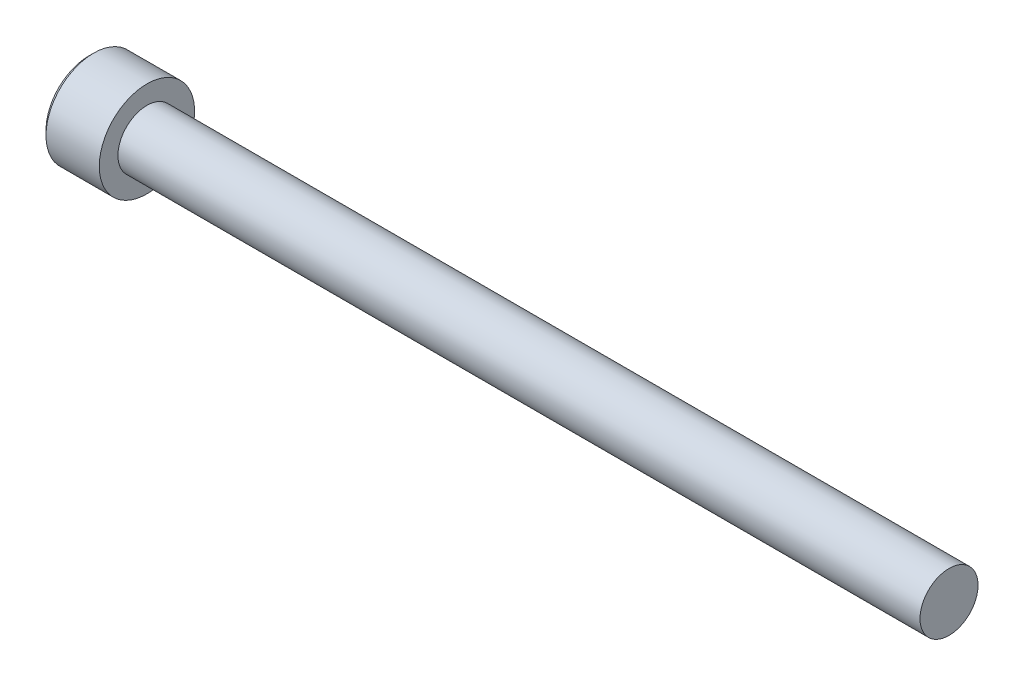
ISO-10303-21;
HEADER;
FILE_DESCRIPTION(('STEP AP214'),'2;1');
FILE_NAME('part.step','',(''),(''),'','','');
FILE_SCHEMA(('AUTOMOTIVE_DESIGN { 1 0 10303 214 1 1 1 1 }'));
ENDSEC;
DATA;
#1=APPLICATION_CONTEXT('core data for automotive mechanical design processes');
#2=APPLICATION_PROTOCOL_DEFINITION('international standard','automotive_design',2000,#1);
#3=PRODUCT_CONTEXT('',#1,'mechanical');
#4=PRODUCT('Part','Part','',(#3));
#5=PRODUCT_RELATED_PRODUCT_CATEGORY('part','',(#4));
#6=PRODUCT_DEFINITION_FORMATION('','',#4);
#7=PRODUCT_DEFINITION_CONTEXT('part definition',#1,'design');
#8=PRODUCT_DEFINITION('design','',#6,#7);
#9=PRODUCT_DEFINITION_SHAPE('','',#8);
#10=(LENGTH_UNIT() NAMED_UNIT(*) SI_UNIT(.MILLI.,.METRE.));
#11=(NAMED_UNIT(*) PLANE_ANGLE_UNIT() SI_UNIT($,.RADIAN.));
#12=(NAMED_UNIT(*) SI_UNIT($,.STERADIAN.) SOLID_ANGLE_UNIT());
#13=UNCERTAINTY_MEASURE_WITH_UNIT(LENGTH_MEASURE(1.E-05),#10,'distance_accuracy_value','');
#14=(GEOMETRIC_REPRESENTATION_CONTEXT(3) GLOBAL_UNCERTAINTY_ASSIGNED_CONTEXT((#13)) GLOBAL_UNIT_ASSIGNED_CONTEXT((#10,
#11,#12)) REPRESENTATION_CONTEXT('',''));
#15=CARTESIAN_POINT('',(0.,0.,0.));
#16=DIRECTION('',(0.,0.,1.));
#17=DIRECTION('',(1.,0.,0.));
#18=AXIS2_PLACEMENT_3D('',#15,#16,#17);
#19=CARTESIAN_POINT('',(-2.28600000000007,-1.14567944042317,1.984375));
#20=DIRECTION('',(0.,0.,1.));
#21=DIRECTION('',(1.,0.,0.));
#22=AXIS2_PLACEMENT_3D('',#19,#20,#21);
#23=PLANE('',#22);
#24=CARTESIAN_POINT('',(-4.82599999995852,1.14567944044653,1.98437499999554));
#25=CARTESIAN_POINT('',(-4.78691618362732,1.06743880343266,1.9843749999984));
#26=CARTESIAN_POINT('',(-4.75011447684892,0.987898318960917,1.98437499999957));
#27=CARTESIAN_POINT('',(-4.68265620500518,0.825677042028778,1.98437500000043));
#28=CARTESIAN_POINT('',(-4.65204056061138,0.742979382529199,1.98437500000012));
#29=CARTESIAN_POINT('',(-4.5991739228306,0.575193959555969,1.98437499999988));
#30=CARTESIAN_POINT('',(-4.57689462080725,0.490115359117279,1.98437499999997));
#31=CARTESIAN_POINT('',(-4.54259467221837,0.318093091130193,1.98437500000003));
#32=CARTESIAN_POINT('',(-4.5305423022885,0.231156054976726,1.984375));
#33=CARTESIAN_POINT('',(-4.52249110263747,0.119918521511051,1.984375));
#34=CARTESIAN_POINT('',(-4.52118947557477,0.0959468443046798,1.984375));
#35=CARTESIAN_POINT('',(-4.51945182629813,0.0479845644411998,1.984375));
#36=CARTESIAN_POINT('',(-4.51901533386223,0.0239939791589393,1.984375));
#37=CARTESIAN_POINT('',(-4.51901809008399,-0.0602201717457363,1.984375));
#38=CARTESIAN_POINT('',(-4.52177452299902,-0.120461721905447,1.984375));
#39=CARTESIAN_POINT('',(-4.5326365512493,-0.240474970989197,1.984375));
#40=CARTESIAN_POINT('',(-4.54074587749718,-0.300246312758427,1.984375));
#41=CARTESIAN_POINT('',(-4.57259622946939,-0.478763752804282,1.984375));
#42=CARTESIAN_POINT('',(-4.60385422611702,-0.596208828937734,1.984375));
#43=CARTESIAN_POINT('',(-4.66780003592237,-0.785921487441256,1.984375));
#44=CARTESIAN_POINT('',(-4.69623457768558,-0.859734609866899,1.984375));
#45=CARTESIAN_POINT('',(-4.75786140400812,-1.00456595519282,1.984375));
#46=CARTESIAN_POINT('',(-4.79100779300359,-1.07560356657101,1.984375));
#47=CARTESIAN_POINT('',(-4.82599999995643,-1.14567944044724,1.984375));
#48=B_SPLINE_CURVE_WITH_KNOTS('',3,(#24,#25,#26,#27,#28,#29,#30,#31,#32,#33,#34,#35,#36,#37,#38,
#39,#40,#41,#42,#43,#44,#45,#46,#47),.UNSPECIFIED.,.F.,.F.,(4,2,2,2,2,2,2,2,2,2,2,4),(0.,
0.262559005207405,0.526801735838036,0.790138824405318,1.05265603861765,1.12466619182083,
1.19663719499031,1.3772702672652,1.55802937209382,1.92104085090328,2.15819130092264,
2.39317265078575),.UNSPECIFIED.);
#49=CARTESIAN_POINT('',(-4.82599999996829,1.14567944041753,1.98437500003084));
#50=VERTEX_POINT('',#49);
#51=CARTESIAN_POINT('',(-4.8259999999622,-1.14567944043207,1.98437500001542));
#52=VERTEX_POINT('',#51);
#53=EDGE_CURVE('E20',#50,#52,#48,.T.);
#54=ORIENTED_EDGE('',*,*,#53,.F.);
#55=DIRECTION('',(1.,0.,0.));
#56=VECTOR('',#55,1.);
#57=CARTESIAN_POINT('',(-2.28600000000007,1.14567944042316,1.984375));
#58=LINE('',#57,#56);
#59=CARTESIAN_POINT('',(-2.28600000000007,1.14567944042316,1.984375));
#60=VERTEX_POINT('',#59);
#61=EDGE_CURVE('E68',#50,#60,#58,.T.);
#62=ORIENTED_EDGE('',*,*,#61,.T.);
#63=DIRECTION('',(0.,1.,0.));
#64=VECTOR('',#63,1.);
#65=CARTESIAN_POINT('',(-2.28600000000007,0.,1.984375));
#66=LINE('',#65,#64);
#67=CARTESIAN_POINT('',(-2.28600000000007,-1.14567944042317,1.984375));
#68=VERTEX_POINT('',#67);
#69=EDGE_CURVE('E74',#68,#60,#66,.T.);
#70=ORIENTED_EDGE('',*,*,#69,.F.);
#71=DIRECTION('',(1.,0.,0.));
#72=VECTOR('',#71,1.);
#73=CARTESIAN_POINT('',(-2.28600000000007,-1.14567944042317,1.984375));
#74=LINE('',#73,#72);
#75=EDGE_CURVE('E71',#68,#52,#74,.F.);
#76=ORIENTED_EDGE('',*,*,#75,.T.);
#77=EDGE_LOOP('',(#54,#62,#70,#76));
#78=FACE_BOUND('',#77,.T.);
#79=ADVANCED_FACE('F16',(#78),#23,.F.);
#80=CARTESIAN_POINT('',(-2.28600000000007,0.,0.));
#81=DIRECTION('',(-1.,0.,0.));
#82=DIRECTION('',(0.,0.,1.));
#83=AXIS2_PLACEMENT_3D('',#80,#81,#82);
#84=PLANE('',#83);
#85=DIRECTION('',(0.,0.5,0.866025403784439));
#86=VECTOR('',#85,1.);
#87=CARTESIAN_POINT('',(-2.28600000000007,2.29135888084633,0.));
#88=LINE('',#87,#86);
#89=CARTESIAN_POINT('',(-2.28600000000007,2.29135888084633,0.));
#90=VERTEX_POINT('',#89);
#91=CARTESIAN_POINT('',(-2.28600000000007,1.14567944042316,-1.984375));
#92=VERTEX_POINT('',#91);
#93=EDGE_CURVE('E82',#90,#92,#88,.F.);
#94=ORIENTED_EDGE('',*,*,#93,.T.);
#95=DIRECTION('',(0.,1.,0.));
#96=VECTOR('',#95,1.);
#97=CARTESIAN_POINT('',(-2.28600000000007,1.14567944042316,-1.984375));
#98=LINE('',#97,#96);
#99=CARTESIAN_POINT('',(-2.28600000000007,-1.14567944042316,-1.984375));
#100=VERTEX_POINT('',#99);
#101=EDGE_CURVE('E242',#92,#100,#98,.F.);
#102=ORIENTED_EDGE('',*,*,#101,.T.);
#103=DIRECTION('',(0.,0.5,-0.866025403784439));
#104=VECTOR('',#103,1.);
#105=CARTESIAN_POINT('',(-2.28600000000007,-1.14567944042316,-1.984375));
#106=LINE('',#105,#104);
#107=CARTESIAN_POINT('',(-2.28600000000007,-2.29135888084633,0.));
#108=VERTEX_POINT('',#107);
#109=EDGE_CURVE('E227',#100,#108,#106,.F.);
#110=ORIENTED_EDGE('',*,*,#109,.T.);
#111=DIRECTION('',(0.,-0.5,-0.866025403784439));
#112=VECTOR('',#111,1.);
#113=CARTESIAN_POINT('',(-2.28600000000007,-2.29135888084633,0.));
#114=LINE('',#113,#112);
#115=EDGE_CURVE('E224',#108,#68,#114,.F.);
#116=ORIENTED_EDGE('',*,*,#115,.T.);
#117=ORIENTED_EDGE('',*,*,#69,.T.);
#118=DIRECTION('',(0.,-0.5,0.866025403784439));
#119=VECTOR('',#118,1.);
#120=CARTESIAN_POINT('',(-2.28600000000007,1.14567944042316,1.984375));
#121=LINE('',#120,#119);
#122=EDGE_CURVE('E81',#60,#90,#121,.F.);
#123=ORIENTED_EDGE('',*,*,#122,.T.);
#124=EDGE_LOOP('',(#94,#102,#110,#116,#117,#123));
#125=FACE_BOUND('',#124,.T.);
#126=ADVANCED_FACE('F160',(#125),#84,.T.);
#127=CARTESIAN_POINT('',(-2.28600000000007,-1.14567944042316,-1.984375));
#128=DIRECTION('',(0.,-0.866025403784439,-0.5));
#129=DIRECTION('',(0.,0.5,-0.866025403784439));
#130=AXIS2_PLACEMENT_3D('',#127,#128,#129);
#131=PLANE('',#130);
#132=CARTESIAN_POINT('',(-4.82599999995871,-1.14567944040756,-1.98437500001887));
#133=CARTESIAN_POINT('',(-4.78666022792997,-1.18505700230148,-1.91617106214563));
#134=CARTESIAN_POINT('',(-4.74963132844072,-1.22509295783734,-1.8468267530301));
#135=CARTESIAN_POINT('',(-4.68183299424977,-1.30673037975396,-1.70542659047317));
#136=CARTESIAN_POINT('',(-4.65110127019237,-1.34833960561553,-1.63335729721673));
#137=CARTESIAN_POINT('',(-4.59845762010516,-1.432242568594,-1.48803310243203));
#138=CARTESIAN_POINT('',(-4.57641341195893,-1.47451494967301,-1.41481519064643));
#139=CARTESIAN_POINT('',(-4.54245011067441,-1.55999007976842,-1.26676792253773));
#140=CARTESIAN_POINT('',(-4.53050567471972,-1.6031902195197,-1.19194308559438));
#141=CARTESIAN_POINT('',(-4.51972842752365,-1.67764765054852,-1.06297903205139));
#142=CARTESIAN_POINT('',(-4.51813352794834,-1.70880881707173,-1.00900630841009));
#143=CARTESIAN_POINT('',(-4.52082392138599,-1.77108016542046,-0.901149169214274));
#144=CARTESIAN_POINT('',(-4.52511127545884,-1.80219032554946,-0.847264791239237));
#145=CARTESIAN_POINT('',(-4.53932219421538,-1.86411684097343,-0.740004920189235));
#146=CARTESIAN_POINT('',(-4.54925206045723,-1.8949328285454,-0.686630064029166));
#147=CARTESIAN_POINT('',(-4.5742029484467,-1.95603190279815,-0.580803363127978));
#148=CARTESIAN_POINT('',(-4.58922357974385,-1.98631503016081,-0.528351447923769));
#149=CARTESIAN_POINT('',(-4.63380478900425,-2.06386502548479,-0.394030915895904));
#150=CARTESIAN_POINT('',(-4.66672213384104,-2.11065153226583,-0.312994309042484));
#151=CARTESIAN_POINT('',(-4.72228952038986,-2.17944749410732,-0.193836207777459));
#152=CARTESIAN_POINT('',(-4.74181309375939,-2.20211890802843,-0.154568166986659));
#153=CARTESIAN_POINT('',(-4.78263970065987,-2.24704195201531,-0.0767591723707469));
#154=CARTESIAN_POINT('',(-4.80394164363173,-2.2692938292399,-0.0382177904539708));
#155=CARTESIAN_POINT('',(-4.82599999995675,-2.29135888085868,2.13931096265935E-11));
#156=B_SPLINE_CURVE_WITH_KNOTS('',3,(#132,#133,#134,#135,#136,#137,#138,#139,#140,#141,#142,
#143,#144,#145,#146,#147,#148,#149,#150,#151,#152,#153,#154,#155),.UNSPECIFIED.,.F.,.F.,(4,2,2,
2,2,2,2,2,2,2,2,4),(0.,0.264284909626495,0.530108996358094,0.791712695414128,1.05265800174404,
1.23942150116703,1.42625045663858,1.61328847394198,1.80031214908683,2.09727151182814,
2.24534838946042,2.39333511890876),.UNSPECIFIED.);
#157=CARTESIAN_POINT('',(-4.8259999999622,-1.14567944043207,-1.98437500001542));
#158=VERTEX_POINT('',#157);
#159=CARTESIAN_POINT('',(-4.82599999996846,-2.2913588808704,-2.00043543490866E-11));
#160=VERTEX_POINT('',#159);
#161=EDGE_CURVE('E162',#158,#160,#156,.T.);
#162=ORIENTED_EDGE('',*,*,#161,.T.);
#163=DIRECTION('',(1.,0.,0.));
#164=VECTOR('',#163,1.);
#165=CARTESIAN_POINT('',(-2.28600000000007,-2.29135888084633,0.));
#166=LINE('',#165,#164);
#167=EDGE_CURVE('E235',#160,#108,#166,.T.);
#168=ORIENTED_EDGE('',*,*,#167,.T.);
#169=ORIENTED_EDGE('',*,*,#109,.F.);
#170=DIRECTION('',(-1.,0.,0.));
#171=VECTOR('',#170,1.);
#172=CARTESIAN_POINT('',(-2.28600000000007,-1.14567944042316,-1.984375));
#173=LINE('',#172,#171);
#174=EDGE_CURVE('E245',#100,#158,#173,.T.);
#175=ORIENTED_EDGE('',*,*,#174,.T.);
#176=EDGE_LOOP('',(#162,#168,#169,#175));
#177=FACE_BOUND('',#176,.T.);
#178=ADVANCED_FACE('F156',(#177),#131,.F.);
#179=CARTESIAN_POINT('',(-2.28600000000007,-2.29135888084633,0.));
#180=DIRECTION('',(0.,-0.866025403784439,0.5));
#181=DIRECTION('',(0.,-0.5,-0.866025403784439));
#182=AXIS2_PLACEMENT_3D('',#179,#180,#181);
#183=PLANE('',#182);
#184=CARTESIAN_POINT('',(-4.8259999999587,-2.29135888085486,-2.29477011545215E-11));
#185=CARTESIAN_POINT('',(-4.78666022792997,-2.25198131896546,0.0682039378529047));
#186=CARTESIAN_POINT('',(-4.74963132844072,-2.21194536343147,0.137548246969502));
#187=CARTESIAN_POINT('',(-4.68183299424977,-2.13030794151622,0.278948409527228));
#188=CARTESIAN_POINT('',(-4.65110127019237,-2.08869871565414,0.351017702783377));
#189=CARTESIAN_POINT('',(-4.59845762010516,-2.00479575267531,0.496341897567867));
#190=CARTESIAN_POINT('',(-4.57641341195893,-1.96252337159644,0.569559809353539));
#191=CARTESIAN_POINT('',(-4.5424501106744,-1.87704824150112,0.717607077462299));
#192=CARTESIAN_POINT('',(-4.53050567471972,-1.8338481017498,0.792431914405622));
#193=CARTESIAN_POINT('',(-4.51972842752365,-1.75939067072096,0.921395967948603));
#194=CARTESIAN_POINT('',(-4.51813352794834,-1.72822950419776,0.975368691589913));
#195=CARTESIAN_POINT('',(-4.52082392138599,-1.66595815584903,1.08322583078573));
#196=CARTESIAN_POINT('',(-4.52511127545884,-1.63484799572003,1.13711020876076));
#197=CARTESIAN_POINT('',(-4.53932219421538,-1.57292148029607,1.24437007981077));
#198=CARTESIAN_POINT('',(-4.54925206045723,-1.54210549272409,1.29774493597084));
#199=CARTESIAN_POINT('',(-4.5742029484467,-1.48100641847134,1.40357163687202));
#200=CARTESIAN_POINT('',(-4.58922357974385,-1.45072329110868,1.45602355207623));
#201=CARTESIAN_POINT('',(-4.63380478900421,-1.37317329578476,1.59034408410398));
#202=CARTESIAN_POINT('',(-4.66672213384095,-1.32638678900379,1.6713806909573));
#203=CARTESIAN_POINT('',(-4.72228952038968,-1.25759082716239,1.79053879222216));
#204=CARTESIAN_POINT('',(-4.74181309375917,-1.23491941324131,1.82980683301291));
#205=CARTESIAN_POINT('',(-4.78263970065959,-1.18999636925449,1.90761582762873));
#206=CARTESIAN_POINT('',(-4.8039416436314,-1.16774449202993,1.94615720954545));
#207=CARTESIAN_POINT('',(-4.82599999995639,-1.14567944041117,1.98437500002077));
#208=B_SPLINE_CURVE_WITH_KNOTS('',3,(#184,#185,#186,#187,#188,#189,#190,#191,#192,#193,#194,
#195,#196,#197,#198,#199,#200,#201,#202,#203,#204,#205,#206,#207),.UNSPECIFIED.,.F.,.F.,(4,2,2,
2,2,2,2,2,2,2,2,4),(0.,0.264284909626493,0.530108996358089,0.791712695414125,1.05265800174404,
1.23942150116703,1.42625045663858,1.61328847394198,1.80031214908683,2.09727151182773,
2.24534838945981,2.39333511890795),.UNSPECIFIED.);
#209=EDGE_CURVE('E91',#160,#52,#208,.T.);
#210=ORIENTED_EDGE('',*,*,#209,.T.);
#211=ORIENTED_EDGE('',*,*,#75,.F.);
#212=ORIENTED_EDGE('',*,*,#115,.F.);
#213=ORIENTED_EDGE('',*,*,#167,.F.);
#214=EDGE_LOOP('',(#210,#211,#212,#213));
#215=FACE_BOUND('',#214,.T.);
#216=ADVANCED_FACE('F151',(#215),#183,.F.);
#217=CARTESIAN_POINT('',(-2.28600000000007,1.14567944042316,1.984375));
#218=DIRECTION('',(0.,0.866025403784439,0.5));
#219=DIRECTION('',(0.,-0.5,0.866025403784439));
#220=AXIS2_PLACEMENT_3D('',#217,#218,#219);
#221=PLANE('',#220);
#222=CARTESIAN_POINT('',(-4.82599999995852,1.14567944040762,1.98437500001801));
#223=CARTESIAN_POINT('',(-4.78666022792973,1.1850570023017,1.91617106214498));
#224=CARTESIAN_POINT('',(-4.74963132844047,1.22509295783761,1.84682675302957));
#225=CARTESIAN_POINT('',(-4.68183299424957,1.30673037975422,1.70542659047278));
#226=CARTESIAN_POINT('',(-4.65110127019222,1.34833960561574,1.63335729721638));
#227=CARTESIAN_POINT('',(-4.59845762010509,1.43224256859413,1.48803310243178));
#228=CARTESIAN_POINT('',(-4.57641341195888,1.47451494967311,1.41481519064625));
#229=CARTESIAN_POINT('',(-4.54245011067439,1.55999007976846,1.26676792253767));
#230=CARTESIAN_POINT('',(-4.53050567471972,1.6031902195197,1.19194308559439));
#231=CARTESIAN_POINT('',(-4.51972842752365,1.67764765054848,1.06297903205146));
#232=CARTESIAN_POINT('',(-4.51813352794835,1.70880881707169,1.00900630841016));
#233=CARTESIAN_POINT('',(-4.52082392138598,1.77108016542041,0.901149169214364));
#234=CARTESIAN_POINT('',(-4.52511127545883,1.80219032554941,0.847264791239333));
#235=CARTESIAN_POINT('',(-4.53932219421536,1.86411684097336,0.740004920189342));
#236=CARTESIAN_POINT('',(-4.54925206045721,1.89493282854533,0.686630064029278));
#237=CARTESIAN_POINT('',(-4.57420294844667,1.95603190279808,0.5808033631281));
#238=CARTESIAN_POINT('',(-4.58922357974382,1.98631503016074,0.528351447923897));
#239=CARTESIAN_POINT('',(-4.6338047890042,2.06386502548473,0.394030915896012));
#240=CARTESIAN_POINT('',(-4.666722133841,2.11065153226578,0.312994309042568));
#241=CARTESIAN_POINT('',(-4.72228952038984,2.17944749410729,0.19383620777751));
#242=CARTESIAN_POINT('',(-4.74181309375937,2.20211890802841,0.1545681669867));
#243=CARTESIAN_POINT('',(-4.78263970065986,2.24704195201529,0.0767591723707674));
#244=CARTESIAN_POINT('',(-4.80394164363172,2.26929382923989,0.0382177904539813));
#245=CARTESIAN_POINT('',(-4.82599999995675,2.29135888085868,-2.1392886942985E-11));
#246=B_SPLINE_CURVE_WITH_KNOTS('',3,(#222,#223,#224,#225,#226,#227,#228,#229,#230,#231,#232,
#233,#234,#235,#236,#237,#238,#239,#240,#241,#242,#243,#244,#245),.UNSPECIFIED.,.F.,.F.,(4,2,2,
2,2,2,2,2,2,2,2,4),(0.,0.26428490962629,0.530108996357672,0.791712695413487,1.05265800174319,
1.23942150116616,1.42625045663768,1.61328847394106,1.80031214908589,2.09727151182728,
2.2453483894596,2.39333511890798),.UNSPECIFIED.);
#247=CARTESIAN_POINT('',(-4.82599999996846,2.29135888087039,2.00042061038936E-11));
#248=VERTEX_POINT('',#247);
#249=EDGE_CURVE('E79',#50,#248,#246,.T.);
#250=ORIENTED_EDGE('',*,*,#249,.T.);
#251=DIRECTION('',(1.,0.,0.));
#252=VECTOR('',#251,1.);
#253=CARTESIAN_POINT('',(-2.28600000000007,2.29135888084633,0.));
#254=LINE('',#253,#252);
#255=EDGE_CURVE('E246',#248,#90,#254,.T.);
#256=ORIENTED_EDGE('',*,*,#255,.T.);
#257=ORIENTED_EDGE('',*,*,#122,.F.);
#258=ORIENTED_EDGE('',*,*,#61,.F.);
#259=EDGE_LOOP('',(#250,#256,#257,#258));
#260=FACE_BOUND('',#259,.T.);
#261=ADVANCED_FACE('F76',(#260),#221,.F.);
#262=CARTESIAN_POINT('',(-2.28600000000007,2.29135888084633,0.));
#263=DIRECTION('',(0.,0.866025403784439,-0.5));
#264=DIRECTION('',(0.,0.5,0.866025403784439));
#265=AXIS2_PLACEMENT_3D('',#262,#263,#264);
#266=PLANE('',#265);
#267=CARTESIAN_POINT('',(-4.82599999995871,2.29135888085486,2.29489280696874E-11));
#268=CARTESIAN_POINT('',(-4.78666022792997,2.25198131896547,-0.0682039378529039));
#269=CARTESIAN_POINT('',(-4.74963132844072,2.21194536343147,-0.137548246969502));
#270=CARTESIAN_POINT('',(-4.68183299424977,2.13030794151622,-0.278948409527229));
#271=CARTESIAN_POINT('',(-4.65110127019237,2.08869871565414,-0.351017702783379));
#272=CARTESIAN_POINT('',(-4.59845762010516,2.00479575267531,-0.496341897567869));
#273=CARTESIAN_POINT('',(-4.57641341195893,1.96252337159644,-0.569559809353541));
#274=CARTESIAN_POINT('',(-4.5424501106744,1.87704824150112,-0.7176070774623));
#275=CARTESIAN_POINT('',(-4.53050567471972,1.8338481017498,-0.792431914405622));
#276=CARTESIAN_POINT('',(-4.51972842752365,1.75939067072096,-0.921395967948603));
#277=CARTESIAN_POINT('',(-4.51813352794834,1.72822950419776,-0.975368691589912));
#278=CARTESIAN_POINT('',(-4.52082392138599,1.66595815584903,-1.08322583078573));
#279=CARTESIAN_POINT('',(-4.52511127545884,1.63484799572003,-1.13711020876076));
#280=CARTESIAN_POINT('',(-4.53932219421538,1.57292148029607,-1.24437007981077));
#281=CARTESIAN_POINT('',(-4.54925206045723,1.54210549272409,-1.29774493597083));
#282=CARTESIAN_POINT('',(-4.5742029484467,1.48100641847134,-1.40357163687202));
#283=CARTESIAN_POINT('',(-4.58922357974385,1.45072329110868,-1.45602355207623));
#284=CARTESIAN_POINT('',(-4.63380478900425,1.3731732957847,-1.5903440841041));
#285=CARTESIAN_POINT('',(-4.66672213384104,1.32638678900366,-1.67138069095752));
#286=CARTESIAN_POINT('',(-4.72228952038986,1.25759082716218,-1.79053879222254));
#287=CARTESIAN_POINT('',(-4.74181309375939,1.23491941324106,-1.82980683301334));
#288=CARTESIAN_POINT('',(-4.78263970065987,1.18999636925419,-1.90761582762925));
#289=CARTESIAN_POINT('',(-4.80394164363173,1.1677444920296,-1.94615720954603));
#290=CARTESIAN_POINT('',(-4.82599999995675,1.14567944041081,-1.98437500002139));
#291=B_SPLINE_CURVE_WITH_KNOTS('',3,(#267,#268,#269,#270,#271,#272,#273,#274,#275,#276,#277,
#278,#279,#280,#281,#282,#283,#284,#285,#286,#287,#288,#289,#290),.UNSPECIFIED.,.F.,.F.,(4,2,2,
2,2,2,2,2,2,2,2,4),(0.,0.264284909626495,0.530108996358093,0.791712695414127,1.05265800174404,
1.23942150116703,1.42625045663858,1.61328847394198,1.80031214908683,2.09727151182814,
2.24534838946042,2.39333511890876),.UNSPECIFIED.);
#292=CARTESIAN_POINT('',(-4.82599999996846,1.14567944045252,-1.98437500001084));
#293=VERTEX_POINT('',#292);
#294=EDGE_CURVE('E39',#248,#293,#291,.T.);
#295=ORIENTED_EDGE('',*,*,#294,.T.);
#296=DIRECTION('',(-1.,0.,0.));
#297=VECTOR('',#296,1.);
#298=CARTESIAN_POINT('',(-2.28600000000007,1.14567944042316,-1.984375));
#299=LINE('',#298,#297);
#300=EDGE_CURVE('E166',#293,#92,#299,.F.);
#301=ORIENTED_EDGE('',*,*,#300,.T.);
#302=ORIENTED_EDGE('',*,*,#93,.F.);
#303=ORIENTED_EDGE('',*,*,#255,.F.);
#304=EDGE_LOOP('',(#295,#301,#302,#303));
#305=FACE_BOUND('',#304,.T.);
#306=ADVANCED_FACE('F150',(#305),#266,.F.);
#307=CARTESIAN_POINT('',(-2.28600000000007,1.14567944042316,-1.984375));
#308=DIRECTION('',(0.,0.,-1.));
#309=DIRECTION('',(-1.,0.,0.));
#310=AXIS2_PLACEMENT_3D('',#307,#308,#309);
#311=PLANE('',#310);
#312=CARTESIAN_POINT('',(-4.8259999999587,1.14567944044731,-1.98437499999592));
#313=CARTESIAN_POINT('',(-4.78666022793094,1.06692431665146,-1.98437499999853));
#314=CARTESIAN_POINT('',(-4.74963132844318,0.986852405569011,-1.98437499999961));
#315=CARTESIAN_POINT('',(-4.6818329942566,0.823577561711963,-1.9843750000004));
#316=CARTESIAN_POINT('',(-4.65110127020207,0.740359109975722,-1.98437500000011));
#317=CARTESIAN_POINT('',(-4.59845762012233,0.572553183993917,-1.9843749999999));
#318=CARTESIAN_POINT('',(-4.57641341198063,0.488008421824127,-1.98437499999997));
#319=CARTESIAN_POINT('',(-4.54245011070673,0.317058161610178,-1.98437500000003));
#320=CARTESIAN_POINT('',(-4.53050567475816,0.230657882096267,-1.98437500000001));
#321=CARTESIAN_POINT('',(-4.51972842757294,0.0817430200124032,-1.984375));
#322=CARTESIAN_POINT('',(-4.51813352800283,0.0194206869508218,-1.984375));
#323=CARTESIAN_POINT('',(-4.52082392145254,-0.1051220097764,-1.984375));
#324=CARTESIAN_POINT('',(-4.52511127553227,-0.167342330049008,-1.984375));
#325=CARTESIAN_POINT('',(-4.53932219430377,-0.291195360925477,-1.984375));
#326=CARTESIAN_POINT('',(-4.54925206055372,-0.352827336083362,-1.984375));
#327=CARTESIAN_POINT('',(-4.57420294856008,-0.475025484616114,-1.984375));
#328=CARTESIAN_POINT('',(-4.58922357986604,-0.535591739354747,-1.984375));
#329=CARTESIAN_POINT('',(-4.63380478912724,-0.690691729958653,-1.984375));
#330=CARTESIAN_POINT('',(-4.66672213394715,-0.784264743465576,-1.984375));
#331=CARTESIAN_POINT('',(-4.7222895204619,-0.921856667069616,-1.984375));
#332=CARTESIAN_POINT('',(-4.74181309381856,-0.967199494886089,-1.984375));
#333=CARTESIAN_POINT('',(-4.78263970069104,-1.05704558280959,-1.984375));
#334=CARTESIAN_POINT('',(-4.80394164364776,-1.10154933723428,-1.984375));
#335=CARTESIAN_POINT('',(-4.82599999995675,-1.14567944044787,-1.984375));
#336=B_SPLINE_CURVE_WITH_KNOTS('',3,(#312,#313,#314,#315,#316,#317,#318,#319,#320,#321,#322,
#323,#324,#325,#326,#327,#328,#329,#330,#331,#332,#333,#334,#335),.UNSPECIFIED.,.F.,.F.,(4,2,2,
2,2,2,2,2,2,2,2,4),(0.,0.264284909658836,0.530108996422784,0.791712695509868,1.0526580018708,
1.23942150133878,1.42625045685537,1.61328847420389,1.80031214939384,2.09727151196384,
2.24534838950992,2.39333511887245),.UNSPECIFIED.);
#337=EDGE_CURVE('E108',#293,#158,#336,.T.);
#338=ORIENTED_EDGE('',*,*,#337,.T.);
#339=ORIENTED_EDGE('',*,*,#174,.F.);
#340=ORIENTED_EDGE('',*,*,#101,.F.);
#341=ORIENTED_EDGE('',*,*,#300,.F.);
#342=EDGE_LOOP('',(#338,#339,#340,#341));
#343=FACE_BOUND('',#342,.T.);
#344=ADVANCED_FACE('F121',(#343),#311,.F.);
#345=CARTESIAN_POINT('',(-4.82599999998001,0.,0.));
#346=DIRECTION('',(-1.,0.,0.));
#347=DIRECTION('',(0.,0.,1.));
#348=AXIS2_PLACEMENT_3D('',#345,#346,#347);
#349=CONICAL_SURFACE('',#348,2.29135888088194,0.785398163397448);
#350=ORIENTED_EDGE('',*,*,#161,.F.);
#351=CARTESIAN_POINT('',(-4.82599999998001,0.,0.));
#352=DIRECTION('',(-1.,0.,0.));
#353=DIRECTION('',(0.,0.,1.));
#354=AXIS2_PLACEMENT_3D('',#351,#352,#353);
#355=CIRCLE('',#354,2.29135888088194);
#356=EDGE_CURVE('E105',#158,#160,#355,.T.);
#357=ORIENTED_EDGE('',*,*,#356,.T.);
#358=EDGE_LOOP('',(#350,#357));
#359=FACE_BOUND('',#358,.T.);
#360=ADVANCED_FACE('F167',(#359),#349,.F.);
#361=CARTESIAN_POINT('',(-4.82599999998001,0.,0.));
#362=DIRECTION('',(-1.,0.,0.));
#363=DIRECTION('',(0.,0.,1.));
#364=AXIS2_PLACEMENT_3D('',#361,#362,#363);
#365=CONICAL_SURFACE('',#364,2.29135888088194,0.785398163397448);
#366=ORIENTED_EDGE('',*,*,#209,.F.);
#367=CARTESIAN_POINT('',(-4.82599999998001,0.,0.));
#368=DIRECTION('',(-1.,0.,0.));
#369=DIRECTION('',(0.,0.,1.));
#370=AXIS2_PLACEMENT_3D('',#367,#368,#369);
#371=CIRCLE('',#370,2.29135888088194);
#372=EDGE_CURVE('E86',#160,#52,#371,.T.);
#373=ORIENTED_EDGE('',*,*,#372,.T.);
#374=EDGE_LOOP('',(#366,#373));
#375=FACE_BOUND('',#374,.T.);
#376=ADVANCED_FACE('F170',(#375),#365,.F.);
#377=CARTESIAN_POINT('',(-4.82599999998001,0.,0.));
#378=DIRECTION('',(-1.,0.,0.));
#379=DIRECTION('',(0.,0.,1.));
#380=AXIS2_PLACEMENT_3D('',#377,#378,#379);
#381=CONICAL_SURFACE('',#380,2.29135888088194,0.78539816348948);
#382=CARTESIAN_POINT('',(-4.82599999998001,0.,0.));
#383=DIRECTION('',(-1.,0.,0.));
#384=DIRECTION('',(0.,0.,1.));
#385=AXIS2_PLACEMENT_3D('',#382,#383,#384);
#386=CIRCLE('',#385,2.29135888088194);
#387=EDGE_CURVE('E59',#52,#50,#386,.T.);
#388=ORIENTED_EDGE('',*,*,#387,.T.);
#389=ORIENTED_EDGE('',*,*,#53,.T.);
#390=EDGE_LOOP('',(#388,#389));
#391=FACE_BOUND('',#390,.T.);
#392=ADVANCED_FACE('F84',(#391),#381,.F.);
#393=CARTESIAN_POINT('',(-4.82599999998001,0.,0.));
#394=DIRECTION('',(-1.,0.,0.));
#395=DIRECTION('',(0.,0.,1.));
#396=AXIS2_PLACEMENT_3D('',#393,#394,#395);
#397=CONICAL_SURFACE('',#396,2.29135888088194,0.785398163397448);
#398=ORIENTED_EDGE('',*,*,#249,.F.);
#399=CARTESIAN_POINT('',(-4.82599999998001,0.,0.));
#400=DIRECTION('',(-1.,0.,0.));
#401=DIRECTION('',(0.,0.,1.));
#402=AXIS2_PLACEMENT_3D('',#399,#400,#401);
#403=CIRCLE('',#402,2.29135888088194);
#404=EDGE_CURVE('E85',#50,#248,#403,.T.);
#405=ORIENTED_EDGE('',*,*,#404,.T.);
#406=EDGE_LOOP('',(#398,#405));
#407=FACE_BOUND('',#406,.T.);
#408=ADVANCED_FACE('F90',(#407),#397,.F.);
#409=CARTESIAN_POINT('',(-4.82599999998001,0.,0.));
#410=DIRECTION('',(-1.,0.,0.));
#411=DIRECTION('',(0.,0.,1.));
#412=AXIS2_PLACEMENT_3D('',#409,#410,#411);
#413=CONICAL_SURFACE('',#412,2.29135888088194,0.785398163397448);
#414=ORIENTED_EDGE('',*,*,#294,.F.);
#415=CARTESIAN_POINT('',(-4.82599999998001,0.,0.));
#416=DIRECTION('',(-1.,0.,0.));
#417=DIRECTION('',(0.,0.,1.));
#418=AXIS2_PLACEMENT_3D('',#415,#416,#417);
#419=CIRCLE('',#418,2.29135888088194);
#420=EDGE_CURVE('E97',#248,#293,#419,.T.);
#421=ORIENTED_EDGE('',*,*,#420,.T.);
#422=EDGE_LOOP('',(#414,#421));
#423=FACE_BOUND('',#422,.T.);
#424=ADVANCED_FACE('F128',(#423),#413,.F.);
#425=CARTESIAN_POINT('',(-4.82599999998001,0.,0.));
#426=DIRECTION('',(-1.,0.,0.));
#427=DIRECTION('',(0.,0.,1.));
#428=AXIS2_PLACEMENT_3D('',#425,#426,#427);
#429=CONICAL_SURFACE('',#428,2.29135888088194,0.785398163489476);
#430=ORIENTED_EDGE('',*,*,#337,.F.);
#431=CARTESIAN_POINT('',(-4.82599999998001,0.,0.));
#432=DIRECTION('',(-1.,0.,0.));
#433=DIRECTION('',(0.,0.,1.));
#434=AXIS2_PLACEMENT_3D('',#431,#432,#433);
#435=CIRCLE('',#434,2.29135888088194);
#436=EDGE_CURVE('E99',#293,#158,#435,.T.);
#437=ORIENTED_EDGE('',*,*,#436,.T.);
#438=EDGE_LOOP('',(#430,#437));
#439=FACE_BOUND('',#438,.T.);
#440=ADVANCED_FACE('F124',(#439),#429,.F.);
#441=CARTESIAN_POINT('',(-4.82600000000007,0.,0.));
#442=DIRECTION('',(1.,0.,0.));
#443=DIRECTION('',(0.,0.,-1.));
#444=AXIS2_PLACEMENT_3D('',#441,#442,#443);
#445=PLANE('',#444);
#446=CARTESIAN_POINT('',(-4.82599999998001,0.,0.));
#447=DIRECTION('',(1.,0.,0.));
#448=DIRECTION('',(0.,0.,-1.));
#449=AXIS2_PLACEMENT_3D('',#446,#447,#448);
#450=CIRCLE('',#449,3.56615999999121);
#451=CARTESIAN_POINT('',(-4.82599999998001,0.,-3.56615999999121));
#452=VERTEX_POINT('',#451);
#453=EDGE_CURVE('E212',#452,#452,#450,.T.);
#454=ORIENTED_EDGE('',*,*,#453,.F.);
#455=EDGE_LOOP('',(#454));
#456=FACE_BOUND('',#455,.T.);
#457=ORIENTED_EDGE('',*,*,#420,.F.);
#458=ORIENTED_EDGE('',*,*,#404,.F.);
#459=ORIENTED_EDGE('',*,*,#387,.F.);
#460=ORIENTED_EDGE('',*,*,#372,.F.);
#461=ORIENTED_EDGE('',*,*,#356,.F.);
#462=ORIENTED_EDGE('',*,*,#436,.F.);
#463=EDGE_LOOP('',(#457,#458,#459,#460,#461,#462));
#464=FACE_BOUND('',#463,.T.);
#465=ADVANCED_FACE('F94',(#456,#464),#445,.F.);
#466=CARTESIAN_POINT('',(-4.42976000010731,0.,0.));
#467=DIRECTION('',(1.,0.,0.));
#468=DIRECTION('',(0.,0.,-1.));
#469=AXIS2_PLACEMENT_3D('',#466,#467,#468);
#470=CONICAL_SURFACE('',#469,3.96239999986392,0.785398163397448);
#471=CARTESIAN_POINT('',(-4.42976000000007,0.,0.));
#472=DIRECTION('',(-1.,0.,0.));
#473=DIRECTION('',(0.,0.,1.));
#474=AXIS2_PLACEMENT_3D('',#471,#472,#473);
#475=CIRCLE('',#474,3.9624);
#476=CARTESIAN_POINT('',(-4.42976000000007,0.,3.9624));
#477=VERTEX_POINT('',#476);
#478=EDGE_CURVE('E209',#477,#477,#475,.F.);
#479=ORIENTED_EDGE('',*,*,#478,.F.);
#480=EDGE_LOOP('',(#479));
#481=FACE_BOUND('',#480,.T.);
#482=ORIENTED_EDGE('',*,*,#453,.T.);
#483=EDGE_LOOP('',(#482));
#484=FACE_BOUND('',#483,.T.);
#485=ADVANCED_FACE('F198',(#481,#484),#470,.T.);
#486=CARTESIAN_POINT('',(-4.82600000000008,0.,0.));
#487=DIRECTION('',(-1.,0.,0.));
#488=DIRECTION('',(0.,0.,1.));
#489=AXIS2_PLACEMENT_3D('',#486,#487,#488);
#490=CYLINDRICAL_SURFACE('',#489,3.9624);
#491=ORIENTED_EDGE('',*,*,#478,.T.);
#492=EDGE_LOOP('',(#491));
#493=FACE_BOUND('',#492,.T.);
#494=CARTESIAN_POINT('',(0.,0.,0.));
#495=DIRECTION('',(-1.,0.,0.));
#496=DIRECTION('',(0.,0.,1.));
#497=AXIS2_PLACEMENT_3D('',#494,#495,#496);
#498=CIRCLE('',#497,3.9624);
#499=CARTESIAN_POINT('',(0.,0.,3.9624));
#500=VERTEX_POINT('',#499);
#501=EDGE_CURVE('E214',#500,#500,#498,.T.);
#502=ORIENTED_EDGE('',*,*,#501,.T.);
#503=EDGE_LOOP('',(#502));
#504=FACE_BOUND('',#503,.T.);
#505=ADVANCED_FACE('F195',(#493,#504),#490,.T.);
#506=CARTESIAN_POINT('',(66.675,0.,0.));
#507=DIRECTION('',(1.,0.,0.));
#508=DIRECTION('',(0.,0.,-1.));
#509=AXIS2_PLACEMENT_3D('',#506,#507,#508);
#510=PLANE('',#509);
#511=CARTESIAN_POINT('',(66.675,0.,0.));
#512=DIRECTION('',(-1.,0.,0.));
#513=DIRECTION('',(0.,0.,1.));
#514=AXIS2_PLACEMENT_3D('',#511,#512,#513);
#515=CIRCLE('',#514,2.413);
#516=CARTESIAN_POINT('',(66.675,0.,2.413));
#517=VERTEX_POINT('',#516);
#518=EDGE_CURVE('E30',#517,#517,#515,.T.);
#519=ORIENTED_EDGE('',*,*,#518,.F.);
#520=EDGE_LOOP('',(#519));
#521=FACE_BOUND('',#520,.T.);
#522=ADVANCED_FACE('F188',(#521),#510,.T.);
#523=CARTESIAN_POINT('',(0.,3.9624,0.));
#524=DIRECTION('',(-1.,0.,0.));
#525=DIRECTION('',(0.,0.,1.));
#526=AXIS2_PLACEMENT_3D('',#523,#524,#525);
#527=PLANE('',#526);
#528=CARTESIAN_POINT('',(0.,0.,0.));
#529=DIRECTION('',(-1.,0.,0.));
#530=DIRECTION('',(0.,0.,1.));
#531=AXIS2_PLACEMENT_3D('',#528,#529,#530);
#532=CIRCLE('',#531,2.413);
#533=CARTESIAN_POINT('',(0.,0.,2.413));
#534=VERTEX_POINT('',#533);
#535=EDGE_CURVE('E11',#534,#534,#532,.F.);
#536=ORIENTED_EDGE('',*,*,#535,.F.);
#537=EDGE_LOOP('',(#536));
#538=FACE_BOUND('',#537,.T.);
#539=ORIENTED_EDGE('',*,*,#501,.F.);
#540=EDGE_LOOP('',(#539));
#541=FACE_BOUND('',#540,.T.);
#542=ADVANCED_FACE('F182',(#538,#541),#527,.F.);
#543=CARTESIAN_POINT('',(66.675,0.,0.));
#544=DIRECTION('',(-1.,0.,0.));
#545=DIRECTION('',(0.,0.,1.));
#546=AXIS2_PLACEMENT_3D('',#543,#544,#545);
#547=CYLINDRICAL_SURFACE('',#546,2.413);
#548=ORIENTED_EDGE('',*,*,#535,.T.);
#549=EDGE_LOOP('',(#548));
#550=FACE_BOUND('',#549,.T.);
#551=ORIENTED_EDGE('',*,*,#518,.T.);
#552=EDGE_LOOP('',(#551));
#553=FACE_BOUND('',#552,.T.);
#554=ADVANCED_FACE('F180',(#550,#553),#547,.T.);
#555=CLOSED_SHELL('',(#79,#126,#178,#216,#261,#306,#344,#360,#376,#392,#408,#424,#440,#465,#485,
#505,#522,#542,#554));
#556=MANIFOLD_SOLID_BREP('B1',#555);
#557=ADVANCED_BREP_SHAPE_REPRESENTATION('',(#18,#556),#14);
#558=SHAPE_DEFINITION_REPRESENTATION(#9,#557);
ENDSEC;
END-ISO-10303-21;
